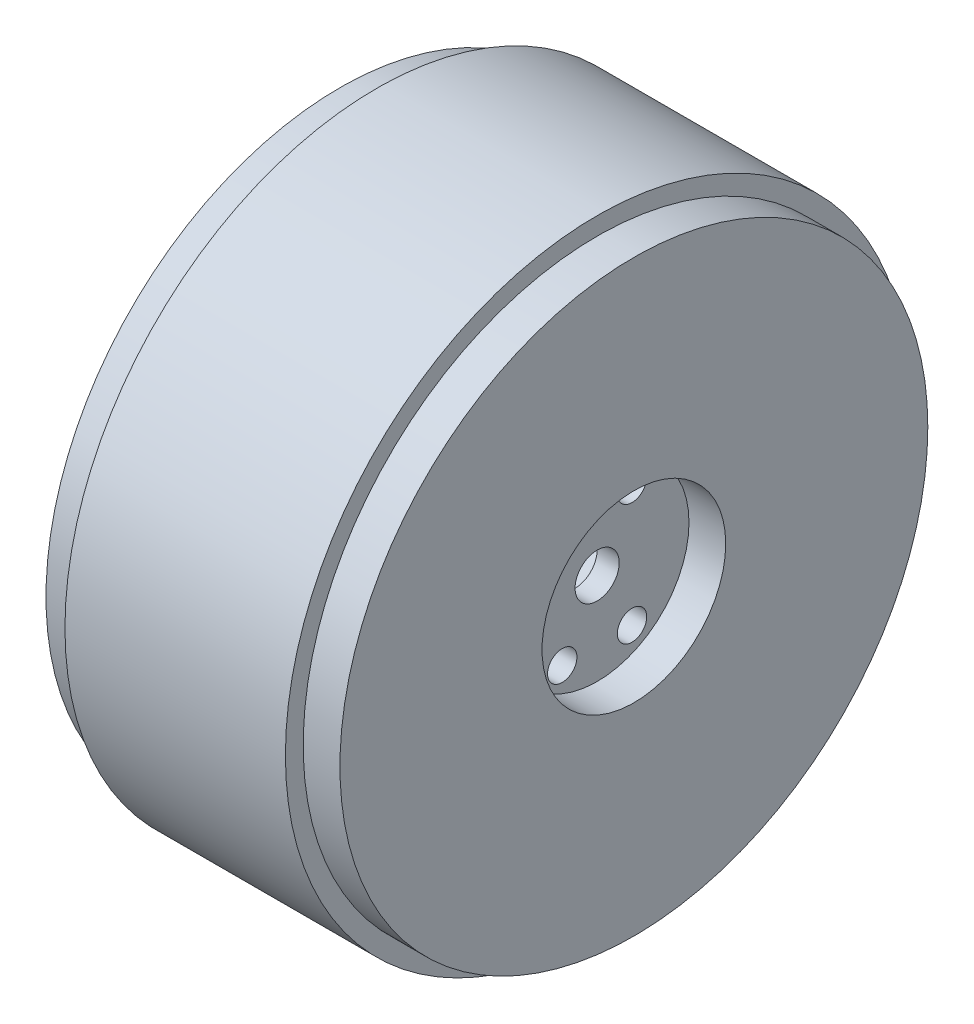
ISO-10303-21;
HEADER;
FILE_DESCRIPTION(('STEP AP214'),'2;1');
FILE_NAME('part.step','',(''),(''),'','','');
FILE_SCHEMA(('AUTOMOTIVE_DESIGN { 1 0 10303 214 1 1 1 1 }'));
ENDSEC;
DATA;
#1=APPLICATION_CONTEXT('core data for automotive mechanical design processes');
#2=APPLICATION_PROTOCOL_DEFINITION('international standard','automotive_design',2000,#1);
#3=PRODUCT_CONTEXT('',#1,'mechanical');
#4=PRODUCT('Part','Part','',(#3));
#5=PRODUCT_RELATED_PRODUCT_CATEGORY('part','',(#4));
#6=PRODUCT_DEFINITION_FORMATION('','',#4);
#7=PRODUCT_DEFINITION_CONTEXT('part definition',#1,'design');
#8=PRODUCT_DEFINITION('design','',#6,#7);
#9=PRODUCT_DEFINITION_SHAPE('','',#8);
#10=(LENGTH_UNIT() NAMED_UNIT(*) SI_UNIT(.MILLI.,.METRE.));
#11=(NAMED_UNIT(*) PLANE_ANGLE_UNIT() SI_UNIT($,.RADIAN.));
#12=(NAMED_UNIT(*) SI_UNIT($,.STERADIAN.) SOLID_ANGLE_UNIT());
#13=UNCERTAINTY_MEASURE_WITH_UNIT(LENGTH_MEASURE(1.E-05),#10,'distance_accuracy_value','');
#14=(GEOMETRIC_REPRESENTATION_CONTEXT(3) GLOBAL_UNCERTAINTY_ASSIGNED_CONTEXT((#13)) GLOBAL_UNIT_ASSIGNED_CONTEXT((#10,
#11,#12)) REPRESENTATION_CONTEXT('',''));
#15=CARTESIAN_POINT('',(0.,0.,0.));
#16=DIRECTION('',(0.,0.,1.));
#17=DIRECTION('',(1.,0.,0.));
#18=AXIS2_PLACEMENT_3D('',#15,#16,#17);
#19=CARTESIAN_POINT('',(-49.6444990272902,0.,0.));
#20=DIRECTION('',(-1.,0.,0.));
#21=DIRECTION('',(0.,0.,-1.));
#22=AXIS2_PLACEMENT_3D('',#19,#20,#21);
#23=CYLINDRICAL_SURFACE('',#22,34.);
#24=CARTESIAN_POINT('',(0.,0.,0.));
#25=DIRECTION('',(1.,0.,0.));
#26=DIRECTION('',(0.,0.,-1.));
#27=AXIS2_PLACEMENT_3D('',#24,#25,#26);
#28=CIRCLE('',#27,34.);
#29=CARTESIAN_POINT('',(0.,0.,-34.));
#30=VERTEX_POINT('',#29);
#31=EDGE_CURVE('E54',#30,#30,#28,.T.);
#32=ORIENTED_EDGE('',*,*,#31,.T.);
#33=EDGE_LOOP('',(#32));
#34=FACE_BOUND('',#33,.T.);
#35=CARTESIAN_POINT('',(-32.,0.,0.));
#36=DIRECTION('',(1.,0.,0.));
#37=DIRECTION('',(0.,0.,-1.));
#38=AXIS2_PLACEMENT_3D('',#35,#36,#37);
#39=CIRCLE('',#38,34.);
#40=CARTESIAN_POINT('',(-32.,0.,-34.));
#41=VERTEX_POINT('',#40);
#42=EDGE_CURVE('E10',#41,#41,#39,.T.);
#43=ORIENTED_EDGE('',*,*,#42,.F.);
#44=EDGE_LOOP('',(#43));
#45=FACE_BOUND('',#44,.T.);
#46=ADVANCED_FACE('F35',(#34,#45),#23,.F.);
#47=CARTESIAN_POINT('',(-32.,34.,0.));
#48=DIRECTION('',(1.,0.,0.));
#49=DIRECTION('',(0.,0.,1.));
#50=AXIS2_PLACEMENT_3D('',#47,#48,#49);
#51=PLANE('',#50);
#52=ORIENTED_EDGE('',*,*,#42,.T.);
#53=EDGE_LOOP('',(#52));
#54=FACE_BOUND('',#53,.T.);
#55=CARTESIAN_POINT('',(-32.,0.,0.));
#56=DIRECTION('',(1.,0.,0.));
#57=DIRECTION('',(0.,0.,-1.));
#58=AXIS2_PLACEMENT_3D('',#55,#56,#57);
#59=CIRCLE('',#58,40.);
#60=CARTESIAN_POINT('',(-32.,0.,-40.));
#61=VERTEX_POINT('',#60);
#62=EDGE_CURVE('E41',#61,#61,#59,.T.);
#63=ORIENTED_EDGE('',*,*,#62,.F.);
#64=EDGE_LOOP('',(#63));
#65=FACE_BOUND('',#64,.T.);
#66=ADVANCED_FACE('F122',(#54,#65),#51,.F.);
#67=CARTESIAN_POINT('',(-49.6444990272902,0.,0.));
#68=DIRECTION('',(-1.,0.,0.));
#69=DIRECTION('',(0.,0.,-1.));
#70=AXIS2_PLACEMENT_3D('',#67,#68,#69);
#71=CYLINDRICAL_SURFACE('',#70,40.);
#72=ORIENTED_EDGE('',*,*,#62,.T.);
#73=EDGE_LOOP('',(#72));
#74=FACE_BOUND('',#73,.T.);
#75=CARTESIAN_POINT('',(-27.,0.,0.));
#76=DIRECTION('',(1.,0.,0.));
#77=DIRECTION('',(0.,0.,-1.));
#78=AXIS2_PLACEMENT_3D('',#75,#76,#77);
#79=CIRCLE('',#78,40.);
#80=CARTESIAN_POINT('',(-27.,0.,-40.));
#81=VERTEX_POINT('',#80);
#82=EDGE_CURVE('E93',#81,#81,#79,.T.);
#83=ORIENTED_EDGE('',*,*,#82,.F.);
#84=EDGE_LOOP('',(#83));
#85=FACE_BOUND('',#84,.T.);
#86=ADVANCED_FACE('F127',(#74,#85),#71,.T.);
#87=CARTESIAN_POINT('',(-49.6444990272902,0.,0.));
#88=DIRECTION('',(-1.,0.,0.));
#89=DIRECTION('',(0.,0.,-1.));
#90=AXIS2_PLACEMENT_3D('',#87,#88,#89);
#91=CYLINDRICAL_SURFACE('',#90,40.);
#92=CARTESIAN_POINT('',(3.,0.,0.));
#93=DIRECTION('',(1.,0.,0.));
#94=DIRECTION('',(0.,0.,-1.));
#95=AXIS2_PLACEMENT_3D('',#92,#93,#94);
#96=CIRCLE('',#95,40.);
#97=CARTESIAN_POINT('',(3.,0.,-40.));
#98=VERTEX_POINT('',#97);
#99=EDGE_CURVE('E45',#98,#98,#96,.T.);
#100=ORIENTED_EDGE('',*,*,#99,.T.);
#101=EDGE_LOOP('',(#100));
#102=FACE_BOUND('',#101,.T.);
#103=CARTESIAN_POINT('',(8.,0.,0.));
#104=DIRECTION('',(1.,0.,0.));
#105=DIRECTION('',(0.,0.,-1.));
#106=AXIS2_PLACEMENT_3D('',#103,#104,#105);
#107=CIRCLE('',#106,40.);
#108=CARTESIAN_POINT('',(8.,0.,-40.));
#109=VERTEX_POINT('',#108);
#110=EDGE_CURVE('E49',#109,#109,#107,.T.);
#111=ORIENTED_EDGE('',*,*,#110,.F.);
#112=EDGE_LOOP('',(#111));
#113=FACE_BOUND('',#112,.T.);
#114=ADVANCED_FACE('F144',(#102,#113),#91,.T.);
#115=CARTESIAN_POINT('',(8.,40.,0.));
#116=DIRECTION('',(-1.,0.,0.));
#117=DIRECTION('',(0.,0.,-1.));
#118=AXIS2_PLACEMENT_3D('',#115,#116,#117);
#119=PLANE('',#118);
#120=CARTESIAN_POINT('',(8.,0.,0.));
#121=DIRECTION('',(1.,0.,0.));
#122=DIRECTION('',(0.,0.,-1.));
#123=AXIS2_PLACEMENT_3D('',#120,#121,#122);
#124=CIRCLE('',#123,12.5);
#125=CARTESIAN_POINT('',(8.,0.,-12.5));
#126=VERTEX_POINT('',#125);
#127=EDGE_CURVE('E57',#126,#126,#124,.T.);
#128=ORIENTED_EDGE('',*,*,#127,.F.);
#129=EDGE_LOOP('',(#128));
#130=FACE_BOUND('',#129,.T.);
#131=ORIENTED_EDGE('',*,*,#110,.T.);
#132=EDGE_LOOP('',(#131));
#133=FACE_BOUND('',#132,.T.);
#134=ADVANCED_FACE('F134',(#130,#133),#119,.F.);
#135=CARTESIAN_POINT('',(0.,34.,0.));
#136=DIRECTION('',(1.,0.,0.));
#137=DIRECTION('',(0.,0.,1.));
#138=AXIS2_PLACEMENT_3D('',#135,#136,#137);
#139=PLANE('',#138);
#140=CARTESIAN_POINT('',(0.,0.,0.));
#141=DIRECTION('',(-1.,0.,0.));
#142=DIRECTION('',(0.,0.,1.));
#143=AXIS2_PLACEMENT_3D('',#140,#141,#142);
#144=CIRCLE('',#143,3.);
#145=CARTESIAN_POINT('',(0.,0.,3.));
#146=VERTEX_POINT('',#145);
#147=EDGE_CURVE('E87',#146,#146,#144,.T.);
#148=ORIENTED_EDGE('',*,*,#147,.F.);
#149=EDGE_LOOP('',(#148));
#150=FACE_BOUND('',#149,.T.);
#151=CARTESIAN_POINT('',(0.,8.22724133595216,-4.75000000000001));
#152=DIRECTION('',(-1.,0.,0.));
#153=DIRECTION('',(0.,0.,1.));
#154=AXIS2_PLACEMENT_3D('',#151,#152,#153);
#155=CIRCLE('',#154,2.);
#156=CARTESIAN_POINT('',(0.,8.22724133595216,-2.75000000000001));
#157=VERTEX_POINT('',#156);
#158=EDGE_CURVE('E63',#157,#157,#155,.T.);
#159=ORIENTED_EDGE('',*,*,#158,.F.);
#160=EDGE_LOOP('',(#159));
#161=FACE_BOUND('',#160,.T.);
#162=CARTESIAN_POINT('',(0.,-8.22724133595216,4.75000000000001));
#163=DIRECTION('',(-1.,0.,0.));
#164=DIRECTION('',(0.,0.,1.));
#165=AXIS2_PLACEMENT_3D('',#162,#163,#164);
#166=CIRCLE('',#165,2.);
#167=CARTESIAN_POINT('',(0.,-8.22724133595216,6.75000000000001));
#168=VERTEX_POINT('',#167);
#169=EDGE_CURVE('E66',#168,#168,#166,.T.);
#170=ORIENTED_EDGE('',*,*,#169,.F.);
#171=EDGE_LOOP('',(#170));
#172=FACE_BOUND('',#171,.T.);
#173=CARTESIAN_POINT('',(0.,-8.22724133595216,-4.75000000000001));
#174=DIRECTION('',(-1.,0.,0.));
#175=DIRECTION('',(0.,0.,1.));
#176=AXIS2_PLACEMENT_3D('',#173,#174,#175);
#177=CIRCLE('',#176,2.);
#178=CARTESIAN_POINT('',(0.,-8.22724133595216,-2.75000000000001));
#179=VERTEX_POINT('',#178);
#180=EDGE_CURVE('E69',#179,#179,#177,.T.);
#181=ORIENTED_EDGE('',*,*,#180,.F.);
#182=EDGE_LOOP('',(#181));
#183=FACE_BOUND('',#182,.T.);
#184=CARTESIAN_POINT('',(0.,8.22724133595216,4.75000000000001));
#185=DIRECTION('',(-1.,0.,0.));
#186=DIRECTION('',(0.,0.,1.));
#187=AXIS2_PLACEMENT_3D('',#184,#185,#186);
#188=CIRCLE('',#187,2.);
#189=CARTESIAN_POINT('',(0.,8.22724133595216,6.75000000000001));
#190=VERTEX_POINT('',#189);
#191=EDGE_CURVE('E72',#190,#190,#188,.T.);
#192=ORIENTED_EDGE('',*,*,#191,.F.);
#193=EDGE_LOOP('',(#192));
#194=FACE_BOUND('',#193,.T.);
#195=ORIENTED_EDGE('',*,*,#31,.F.);
#196=EDGE_LOOP('',(#195));
#197=FACE_BOUND('',#196,.T.);
#198=ADVANCED_FACE('F131',(#150,#161,#172,#183,#194,#197),#139,.F.);
#199=CARTESIAN_POINT('',(0.,0.,0.));
#200=DIRECTION('',(-1.,0.,0.));
#201=DIRECTION('',(0.,0.,-1.));
#202=AXIS2_PLACEMENT_3D('',#199,#200,#201);
#203=CYLINDRICAL_SURFACE('',#202,12.5);
#204=CARTESIAN_POINT('',(3.,0.,0.));
#205=DIRECTION('',(1.,0.,0.));
#206=DIRECTION('',(0.,0.,-1.));
#207=AXIS2_PLACEMENT_3D('',#204,#205,#206);
#208=CIRCLE('',#207,12.5);
#209=CARTESIAN_POINT('',(3.,0.,-12.5));
#210=VERTEX_POINT('',#209);
#211=EDGE_CURVE('E60',#210,#210,#208,.T.);
#212=ORIENTED_EDGE('',*,*,#211,.F.);
#213=EDGE_LOOP('',(#212));
#214=FACE_BOUND('',#213,.T.);
#215=ORIENTED_EDGE('',*,*,#127,.T.);
#216=EDGE_LOOP('',(#215));
#217=FACE_BOUND('',#216,.T.);
#218=ADVANCED_FACE('F133',(#214,#217),#203,.F.);
#219=CARTESIAN_POINT('',(3.,12.5,0.));
#220=DIRECTION('',(1.,0.,0.));
#221=DIRECTION('',(0.,0.,1.));
#222=AXIS2_PLACEMENT_3D('',#219,#220,#221);
#223=PLANE('',#222);
#224=CARTESIAN_POINT('',(3.,0.,0.));
#225=DIRECTION('',(-1.,0.,0.));
#226=DIRECTION('',(0.,0.,1.));
#227=AXIS2_PLACEMENT_3D('',#224,#225,#226);
#228=CIRCLE('',#227,3.);
#229=CARTESIAN_POINT('',(3.,0.,3.));
#230=VERTEX_POINT('',#229);
#231=EDGE_CURVE('E90',#230,#230,#228,.T.);
#232=ORIENTED_EDGE('',*,*,#231,.T.);
#233=EDGE_LOOP('',(#232));
#234=FACE_BOUND('',#233,.T.);
#235=CARTESIAN_POINT('',(3.,8.22724133595216,-4.75000000000001));
#236=DIRECTION('',(-1.,0.,0.));
#237=DIRECTION('',(0.,0.,-1.));
#238=AXIS2_PLACEMENT_3D('',#235,#236,#237);
#239=CIRCLE('',#238,2.);
#240=CARTESIAN_POINT('',(3.,8.22724133595216,-6.75000000000001));
#241=VERTEX_POINT('',#240);
#242=EDGE_CURVE('E78',#241,#241,#239,.T.);
#243=ORIENTED_EDGE('',*,*,#242,.T.);
#244=EDGE_LOOP('',(#243));
#245=FACE_BOUND('',#244,.T.);
#246=CARTESIAN_POINT('',(3.,-8.22724133595216,4.75000000000001));
#247=DIRECTION('',(-1.,0.,0.));
#248=DIRECTION('',(0.,0.,-1.));
#249=AXIS2_PLACEMENT_3D('',#246,#247,#248);
#250=CIRCLE('',#249,2.);
#251=CARTESIAN_POINT('',(3.,-8.22724133595216,2.75000000000001));
#252=VERTEX_POINT('',#251);
#253=EDGE_CURVE('E79',#252,#252,#250,.T.);
#254=ORIENTED_EDGE('',*,*,#253,.T.);
#255=EDGE_LOOP('',(#254));
#256=FACE_BOUND('',#255,.T.);
#257=CARTESIAN_POINT('',(3.,-8.22724133595216,-4.75000000000001));
#258=DIRECTION('',(-1.,0.,0.));
#259=DIRECTION('',(0.,0.,1.));
#260=AXIS2_PLACEMENT_3D('',#257,#258,#259);
#261=CIRCLE('',#260,2.);
#262=CARTESIAN_POINT('',(3.,-8.22724133595216,-2.75000000000001));
#263=VERTEX_POINT('',#262);
#264=EDGE_CURVE('E82',#263,#263,#261,.T.);
#265=ORIENTED_EDGE('',*,*,#264,.T.);
#266=EDGE_LOOP('',(#265));
#267=FACE_BOUND('',#266,.T.);
#268=CARTESIAN_POINT('',(3.,8.22724133595216,4.75000000000001));
#269=DIRECTION('',(-1.,0.,0.));
#270=DIRECTION('',(0.,0.,1.));
#271=AXIS2_PLACEMENT_3D('',#268,#269,#270);
#272=CIRCLE('',#271,2.);
#273=CARTESIAN_POINT('',(3.,8.22724133595216,6.75000000000001));
#274=VERTEX_POINT('',#273);
#275=EDGE_CURVE('E75',#274,#274,#272,.T.);
#276=ORIENTED_EDGE('',*,*,#275,.T.);
#277=EDGE_LOOP('',(#276));
#278=FACE_BOUND('',#277,.T.);
#279=ORIENTED_EDGE('',*,*,#211,.T.);
#280=EDGE_LOOP('',(#279));
#281=FACE_BOUND('',#280,.T.);
#282=ADVANCED_FACE('F141',(#234,#245,#256,#267,#278,#281),#223,.T.);
#283=CARTESIAN_POINT('',(-32.,8.22724133595216,4.75000000000001));
#284=DIRECTION('',(1.,0.,0.));
#285=DIRECTION('',(0.,0.,1.));
#286=AXIS2_PLACEMENT_3D('',#283,#284,#285);
#287=CYLINDRICAL_SURFACE('',#286,2.);
#288=ORIENTED_EDGE('',*,*,#275,.F.);
#289=EDGE_LOOP('',(#288));
#290=FACE_BOUND('',#289,.T.);
#291=ORIENTED_EDGE('',*,*,#191,.T.);
#292=EDGE_LOOP('',(#291));
#293=FACE_BOUND('',#292,.T.);
#294=ADVANCED_FACE('F189',(#290,#293),#287,.F.);
#295=CARTESIAN_POINT('',(-32.,-8.22724133595216,-4.75000000000001));
#296=DIRECTION('',(1.,0.,0.));
#297=DIRECTION('',(0.,0.,1.));
#298=AXIS2_PLACEMENT_3D('',#295,#296,#297);
#299=CYLINDRICAL_SURFACE('',#298,2.);
#300=ORIENTED_EDGE('',*,*,#264,.F.);
#301=EDGE_LOOP('',(#300));
#302=FACE_BOUND('',#301,.T.);
#303=ORIENTED_EDGE('',*,*,#180,.T.);
#304=EDGE_LOOP('',(#303));
#305=FACE_BOUND('',#304,.T.);
#306=ADVANCED_FACE('F198',(#302,#305),#299,.F.);
#307=CARTESIAN_POINT('',(-32.,-8.22724133595216,4.75000000000001));
#308=DIRECTION('',(1.,0.,0.));
#309=DIRECTION('',(0.,0.,1.));
#310=AXIS2_PLACEMENT_3D('',#307,#308,#309);
#311=CYLINDRICAL_SURFACE('',#310,2.);
#312=ORIENTED_EDGE('',*,*,#253,.F.);
#313=EDGE_LOOP('',(#312));
#314=FACE_BOUND('',#313,.T.);
#315=ORIENTED_EDGE('',*,*,#169,.T.);
#316=EDGE_LOOP('',(#315));
#317=FACE_BOUND('',#316,.T.);
#318=ADVANCED_FACE('F208',(#314,#317),#311,.F.);
#319=CARTESIAN_POINT('',(-32.,8.22724133595216,-4.75000000000001));
#320=DIRECTION('',(1.,0.,0.));
#321=DIRECTION('',(0.,0.,1.));
#322=AXIS2_PLACEMENT_3D('',#319,#320,#321);
#323=CYLINDRICAL_SURFACE('',#322,2.);
#324=ORIENTED_EDGE('',*,*,#242,.F.);
#325=EDGE_LOOP('',(#324));
#326=FACE_BOUND('',#325,.T.);
#327=ORIENTED_EDGE('',*,*,#158,.T.);
#328=EDGE_LOOP('',(#327));
#329=FACE_BOUND('',#328,.T.);
#330=ADVANCED_FACE('F218',(#326,#329),#323,.F.);
#331=CARTESIAN_POINT('',(-32.,0.,0.));
#332=DIRECTION('',(1.,0.,0.));
#333=DIRECTION('',(0.,0.,1.));
#334=AXIS2_PLACEMENT_3D('',#331,#332,#333);
#335=CYLINDRICAL_SURFACE('',#334,3.);
#336=ORIENTED_EDGE('',*,*,#231,.F.);
#337=EDGE_LOOP('',(#336));
#338=FACE_BOUND('',#337,.T.);
#339=ORIENTED_EDGE('',*,*,#147,.T.);
#340=EDGE_LOOP('',(#339));
#341=FACE_BOUND('',#340,.T.);
#342=ADVANCED_FACE('F116',(#338,#341),#335,.F.);
#343=CARTESIAN_POINT('',(-27.,39.,0.));
#344=DIRECTION('',(-1.,0.,0.));
#345=DIRECTION('',(0.,0.,-1.));
#346=AXIS2_PLACEMENT_3D('',#343,#344,#345);
#347=PLANE('',#346);
#348=CARTESIAN_POINT('',(-27.,0.,0.));
#349=DIRECTION('',(-1.,0.,0.));
#350=DIRECTION('',(0.,0.,1.));
#351=AXIS2_PLACEMENT_3D('',#348,#349,#350);
#352=CIRCLE('',#351,42.4219137981652);
#353=CARTESIAN_POINT('',(-27.,0.,42.4219137981652));
#354=VERTEX_POINT('',#353);
#355=EDGE_CURVE('E96',#354,#354,#352,.T.);
#356=ORIENTED_EDGE('',*,*,#355,.T.);
#357=EDGE_LOOP('',(#356));
#358=FACE_BOUND('',#357,.T.);
#359=ORIENTED_EDGE('',*,*,#82,.T.);
#360=EDGE_LOOP('',(#359));
#361=FACE_BOUND('',#360,.T.);
#362=ADVANCED_FACE('F107',(#358,#361),#347,.T.);
#363=CARTESIAN_POINT('',(3.,42.4219137981652,0.));
#364=DIRECTION('',(1.,0.,0.));
#365=DIRECTION('',(0.,0.,1.));
#366=AXIS2_PLACEMENT_3D('',#363,#364,#365);
#367=PLANE('',#366);
#368=ORIENTED_EDGE('',*,*,#99,.F.);
#369=EDGE_LOOP('',(#368));
#370=FACE_BOUND('',#369,.T.);
#371=CARTESIAN_POINT('',(3.,0.,0.));
#372=DIRECTION('',(-1.,0.,0.));
#373=DIRECTION('',(0.,0.,1.));
#374=AXIS2_PLACEMENT_3D('',#371,#372,#373);
#375=CIRCLE('',#374,42.4219137981652);
#376=CARTESIAN_POINT('',(3.,0.,42.4219137981652));
#377=VERTEX_POINT('',#376);
#378=EDGE_CURVE('E99',#377,#377,#375,.T.);
#379=ORIENTED_EDGE('',*,*,#378,.F.);
#380=EDGE_LOOP('',(#379));
#381=FACE_BOUND('',#380,.T.);
#382=ADVANCED_FACE('F105',(#370,#381),#367,.T.);
#383=CARTESIAN_POINT('',(0.,0.,0.));
#384=DIRECTION('',(1.,0.,0.));
#385=DIRECTION('',(0.,0.,1.));
#386=AXIS2_PLACEMENT_3D('',#383,#384,#385);
#387=CYLINDRICAL_SURFACE('',#386,42.4219137981652);
#388=ORIENTED_EDGE('',*,*,#355,.F.);
#389=EDGE_LOOP('',(#388));
#390=FACE_BOUND('',#389,.T.);
#391=ORIENTED_EDGE('',*,*,#378,.T.);
#392=EDGE_LOOP('',(#391));
#393=FACE_BOUND('',#392,.T.);
#394=ADVANCED_FACE('F103',(#390,#393),#387,.T.);
#395=CLOSED_SHELL('',(#46,#66,#86,#114,#134,#198,#218,#282,#294,#306,#318,#330,#342,#362,#382,#394));
#396=MANIFOLD_SOLID_BREP('B2',#395);
#397=ADVANCED_BREP_SHAPE_REPRESENTATION('',(#18,#396),#14);
#398=SHAPE_DEFINITION_REPRESENTATION(#9,#397);
ENDSEC;
END-ISO-10303-21;
